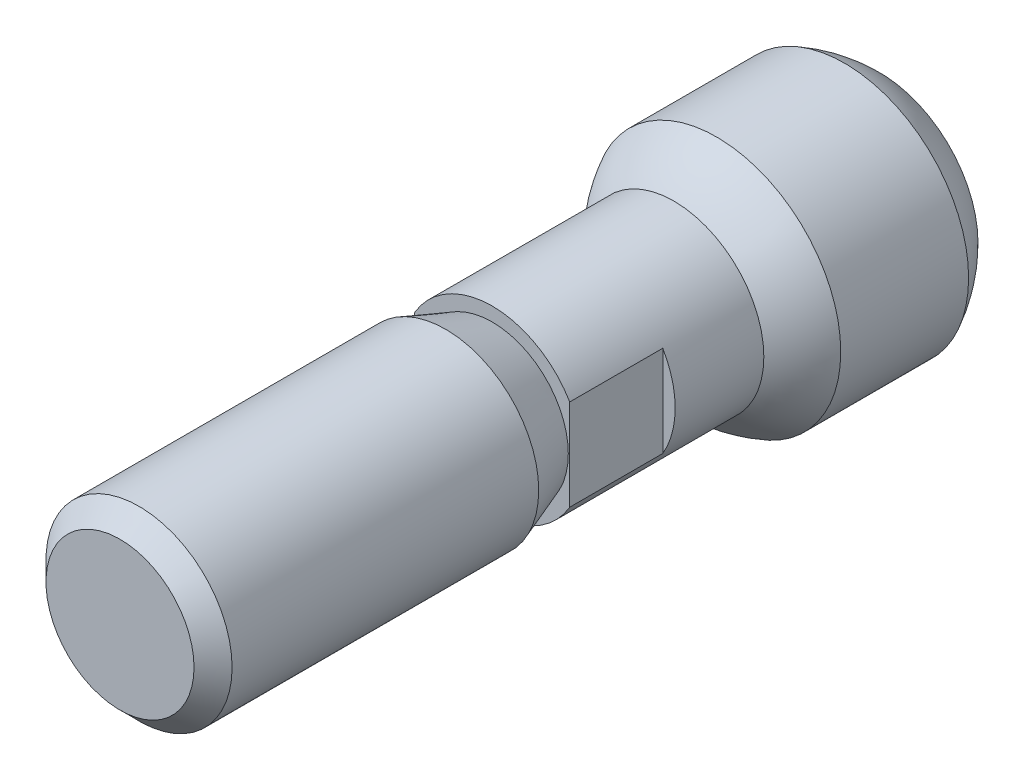
ISO-10303-21;
HEADER;
FILE_DESCRIPTION(('STEP AP214'),'2;1');
FILE_NAME('part.step','',(''),(''),'','','');
FILE_SCHEMA(('AUTOMOTIVE_DESIGN { 1 0 10303 214 1 1 1 1 }'));
ENDSEC;
DATA;
#1=APPLICATION_CONTEXT('core data for automotive mechanical design processes');
#2=APPLICATION_PROTOCOL_DEFINITION('international standard','automotive_design',2000,#1);
#3=PRODUCT_CONTEXT('',#1,'mechanical');
#4=PRODUCT('Part','Part','',(#3));
#5=PRODUCT_RELATED_PRODUCT_CATEGORY('part','',(#4));
#6=PRODUCT_DEFINITION_FORMATION('','',#4);
#7=PRODUCT_DEFINITION_CONTEXT('part definition',#1,'design');
#8=PRODUCT_DEFINITION('design','',#6,#7);
#9=PRODUCT_DEFINITION_SHAPE('','',#8);
#10=(LENGTH_UNIT() NAMED_UNIT(*) SI_UNIT(.MILLI.,.METRE.));
#11=(NAMED_UNIT(*) PLANE_ANGLE_UNIT() SI_UNIT($,.RADIAN.));
#12=(NAMED_UNIT(*) SI_UNIT($,.STERADIAN.) SOLID_ANGLE_UNIT());
#13=UNCERTAINTY_MEASURE_WITH_UNIT(LENGTH_MEASURE(1.E-05),#10,'distance_accuracy_value','');
#14=(GEOMETRIC_REPRESENTATION_CONTEXT(3) GLOBAL_UNCERTAINTY_ASSIGNED_CONTEXT((#13)) GLOBAL_UNIT_ASSIGNED_CONTEXT((#10,
#11,#12)) REPRESENTATION_CONTEXT('',''));
#15=CARTESIAN_POINT('',(0.,0.,0.));
#16=DIRECTION('',(0.,0.,1.));
#17=DIRECTION('',(1.,0.,0.));
#18=AXIS2_PLACEMENT_3D('',#15,#16,#17);
#19=CARTESIAN_POINT('',(0.,0.,1.01536202504548E-13));
#20=DIRECTION('',(0.,0.,-1.));
#21=DIRECTION('',(-1.,0.,0.));
#22=AXIS2_PLACEMENT_3D('',#19,#20,#21);
#23=PLANE('',#22);
#24=CARTESIAN_POINT('',(0.,0.,1.02348685082632E-13));
#25=DIRECTION('',(0.,0.,1.));
#26=DIRECTION('',(1.,0.,0.));
#27=AXIS2_PLACEMENT_3D('',#24,#25,#26);
#28=CIRCLE('',#27,2.9);
#29=CARTESIAN_POINT('',(2.5,1.46969384566974,1.02348685082632E-13));
#30=VERTEX_POINT('',#29);
#31=CARTESIAN_POINT('',(-2.5,1.46969384567006,1.02695629777827E-13));
#32=VERTEX_POINT('',#31);
#33=EDGE_CURVE('E100',#30,#32,#28,.T.);
#34=ORIENTED_EDGE('',*,*,#33,.T.);
#35=DIRECTION('',(0.,-1.,0.));
#36=VECTOR('',#35,1.);
#37=CARTESIAN_POINT('',(-2.5,0.,1.01883147199743E-13));
#38=LINE('',#37,#36);
#39=CARTESIAN_POINT('',(-2.5,-1.46969384567007,1.02348685082632E-13));
#40=VERTEX_POINT('',#39);
#41=EDGE_CURVE('E115',#32,#40,#38,.T.);
#42=ORIENTED_EDGE('',*,*,#41,.T.);
#43=CARTESIAN_POINT('',(2.5,-1.46969384566975,1.02001740387436E-13));
#44=VERTEX_POINT('',#43);
#45=EDGE_CURVE('E93',#40,#44,#28,.T.);
#46=ORIENTED_EDGE('',*,*,#45,.T.);
#47=DIRECTION('',(0.,1.,0.));
#48=VECTOR('',#47,1.);
#49=CARTESIAN_POINT('',(2.5,0.,1.01189257809352E-13));
#50=LINE('',#49,#48);
#51=EDGE_CURVE('E86',#44,#30,#50,.T.);
#52=ORIENTED_EDGE('',*,*,#51,.T.);
#53=EDGE_LOOP('',(#34,#42,#46,#52));
#54=FACE_BOUND('',#53,.T.);
#55=CARTESIAN_POINT('',(0.,0.,1.01536202504548E-13));
#56=DIRECTION('',(0.,0.,-1.));
#57=DIRECTION('',(-1.,0.,0.));
#58=AXIS2_PLACEMENT_3D('',#55,#56,#57);
#59=CIRCLE('',#58,2.45404464860074);
#60=CARTESIAN_POINT('',(-2.45404464860074,0.,1.0187676961359E-13));
#61=VERTEX_POINT('',#60);
#62=EDGE_CURVE('E11',#61,#61,#59,.F.);
#63=ORIENTED_EDGE('',*,*,#62,.F.);
#64=EDGE_LOOP('',(#63));
#65=FACE_BOUND('',#64,.T.);
#66=ADVANCED_FACE('F36',(#54,#65),#23,.F.);
#67=CARTESIAN_POINT('',(0.,0.,-12.4999999999989));
#68=DIRECTION('',(0.,0.,1.));
#69=DIRECTION('',(1.,0.,0.));
#70=AXIS2_PLACEMENT_3D('',#67,#68,#69);
#71=CYLINDRICAL_SURFACE('',#70,2.9);
#72=CARTESIAN_POINT('',(0.,0.,-3.));
#73=DIRECTION('',(0.,0.,1.));
#74=DIRECTION('',(1.,0.,0.));
#75=AXIS2_PLACEMENT_3D('',#72,#73,#74);
#76=CIRCLE('',#75,2.9);
#77=CARTESIAN_POINT('',(-2.5,1.46969384567006,-3.));
#78=VERTEX_POINT('',#77);
#79=CARTESIAN_POINT('',(-2.5,-1.46969384567006,-3.));
#80=VERTEX_POINT('',#79);
#81=EDGE_CURVE('E74',#78,#80,#76,.T.);
#82=ORIENTED_EDGE('',*,*,#81,.F.);
#83=DIRECTION('',(0.,0.,1.));
#84=VECTOR('',#83,1.);
#85=CARTESIAN_POINT('',(-2.5,1.46969384567007,-12.4999999999989));
#86=LINE('',#85,#84);
#87=EDGE_CURVE('E43',#78,#32,#86,.T.);
#88=ORIENTED_EDGE('',*,*,#87,.T.);
#89=ORIENTED_EDGE('',*,*,#33,.F.);
#90=DIRECTION('',(0.,0.,1.));
#91=VECTOR('',#90,1.);
#92=CARTESIAN_POINT('',(2.5,1.46969384566974,-12.4999999999989));
#93=LINE('',#92,#91);
#94=CARTESIAN_POINT('',(2.5,1.46969384566975,-3.));
#95=VERTEX_POINT('',#94);
#96=EDGE_CURVE('E97',#30,#95,#93,.F.);
#97=ORIENTED_EDGE('',*,*,#96,.T.);
#98=CARTESIAN_POINT('',(2.5,-1.46969384566975,-3.));
#99=VERTEX_POINT('',#98);
#100=EDGE_CURVE('E82',#99,#95,#76,.T.);
#101=ORIENTED_EDGE('',*,*,#100,.F.);
#102=DIRECTION('',(0.,0.,1.));
#103=VECTOR('',#102,1.);
#104=CARTESIAN_POINT('',(2.5,-1.46969384566974,-12.4999999999989));
#105=LINE('',#104,#103);
#106=EDGE_CURVE('E80',#99,#44,#105,.T.);
#107=ORIENTED_EDGE('',*,*,#106,.T.);
#108=ORIENTED_EDGE('',*,*,#45,.F.);
#109=DIRECTION('',(0.,0.,1.));
#110=VECTOR('',#109,1.);
#111=CARTESIAN_POINT('',(-2.5,-1.46969384567007,-12.4999999999989));
#112=LINE('',#111,#110);
#113=EDGE_CURVE('E79',#40,#80,#112,.F.);
#114=ORIENTED_EDGE('',*,*,#113,.T.);
#115=EDGE_LOOP('',(#82,#88,#89,#97,#101,#107,#108,#114));
#116=FACE_BOUND('',#115,.T.);
#117=CARTESIAN_POINT('',(0.,0.,-5.8590698931828));
#118=DIRECTION('',(0.,0.,1.));
#119=DIRECTION('',(1.,0.,0.));
#120=AXIS2_PLACEMENT_3D('',#117,#118,#119);
#121=CIRCLE('',#120,2.9);
#122=CARTESIAN_POINT('',(2.89999999999991,0.,-5.8590698931828));
#123=VERTEX_POINT('',#122);
#124=EDGE_CURVE('E103',#123,#123,#121,.T.);
#125=ORIENTED_EDGE('',*,*,#124,.T.);
#126=EDGE_LOOP('',(#125));
#127=FACE_BOUND('',#126,.T.);
#128=ADVANCED_FACE('F89',(#116,#127),#71,.T.);
#129=CARTESIAN_POINT('',(9.03790930983916E-13,0.,-9.3000000000001));
#130=DIRECTION('',(0.,0.,1.));
#131=DIRECTION('',(-1.,0.,0.));
#132=AXIS2_PLACEMENT_3D('',#129,#130,#131);
#133=SPHERICAL_SURFACE('',#132,4.50000000000083);
#134=ORIENTED_EDGE('',*,*,#124,.F.);
#135=EDGE_LOOP('',(#134));
#136=FACE_BOUND('',#135,.T.);
#137=CARTESIAN_POINT('',(0.,0.,-7.2384471871912));
#138=DIRECTION('',(0.,0.,1.));
#139=DIRECTION('',(1.,0.,0.));
#140=AXIS2_PLACEMENT_3D('',#137,#138,#139);
#141=CIRCLE('',#140,3.99999999999991);
#142=CARTESIAN_POINT('',(3.99999999999981,0.,-7.2384471871912));
#143=VERTEX_POINT('',#142);
#144=EDGE_CURVE('E106',#143,#143,#141,.T.);
#145=ORIENTED_EDGE('',*,*,#144,.T.);
#146=EDGE_LOOP('',(#145));
#147=FACE_BOUND('',#146,.T.);
#148=ADVANCED_FACE('F143',(#136,#147),#133,.T.);
#149=CARTESIAN_POINT('',(0.,0.,-12.4999999999989));
#150=DIRECTION('',(0.,0.,1.));
#151=DIRECTION('',(1.,0.,0.));
#152=AXIS2_PLACEMENT_3D('',#149,#150,#151);
#153=CYLINDRICAL_SURFACE('',#152,3.99999999999991);
#154=ORIENTED_EDGE('',*,*,#144,.F.);
#155=EDGE_LOOP('',(#154));
#156=FACE_BOUND('',#155,.T.);
#157=CARTESIAN_POINT('',(0.,0.,-11.361552812809));
#158=DIRECTION('',(0.,0.,1.));
#159=DIRECTION('',(1.,0.,0.));
#160=AXIS2_PLACEMENT_3D('',#157,#158,#159);
#161=CIRCLE('',#160,3.99999999999991);
#162=CARTESIAN_POINT('',(3.99999999999981,0.,-11.361552812809));
#163=VERTEX_POINT('',#162);
#164=EDGE_CURVE('E109',#163,#163,#161,.T.);
#165=ORIENTED_EDGE('',*,*,#164,.T.);
#166=EDGE_LOOP('',(#165));
#167=FACE_BOUND('',#166,.T.);
#168=ADVANCED_FACE('F165',(#156,#167),#153,.T.);
#169=CARTESIAN_POINT('',(9.03790930983916E-13,0.,-9.3000000000001));
#170=DIRECTION('',(0.,0.,1.));
#171=DIRECTION('',(-1.,0.,0.));
#172=AXIS2_PLACEMENT_3D('',#169,#170,#171);
#173=SPHERICAL_SURFACE('',#172,4.50000000000083);
#174=ORIENTED_EDGE('',*,*,#164,.F.);
#175=EDGE_LOOP('',(#174));
#176=FACE_BOUND('',#175,.T.);
#177=CARTESIAN_POINT('',(0.,0.,-12.4999999999989));
#178=DIRECTION('',(0.,0.,1.));
#179=DIRECTION('',(1.,0.,0.));
#180=AXIS2_PLACEMENT_3D('',#177,#178,#179);
#181=CIRCLE('',#180,3.16385840391269);
#182=CARTESIAN_POINT('',(3.1638584039126,0.,-12.4999999999989));
#183=VERTEX_POINT('',#182);
#184=EDGE_CURVE('E112',#183,#183,#181,.T.);
#185=ORIENTED_EDGE('',*,*,#184,.T.);
#186=EDGE_LOOP('',(#185));
#187=FACE_BOUND('',#186,.T.);
#188=ADVANCED_FACE('F161',(#176,#187),#173,.T.);
#189=CARTESIAN_POINT('',(-3.16385840391279,0.,-12.4999999999989));
#190=DIRECTION('',(0.,0.,1.));
#191=DIRECTION('',(1.,0.,0.));
#192=AXIS2_PLACEMENT_3D('',#189,#190,#191);
#193=PLANE('',#192);
#194=ORIENTED_EDGE('',*,*,#184,.F.);
#195=EDGE_LOOP('',(#194));
#196=FACE_BOUND('',#195,.T.);
#197=ADVANCED_FACE('F156',(#196),#193,.F.);
#198=CARTESIAN_POINT('',(0.,0.,-3.));
#199=DIRECTION('',(0.,0.,1.));
#200=DIRECTION('',(1.,0.,0.));
#201=AXIS2_PLACEMENT_3D('',#198,#199,#200);
#202=PLANE('',#201);
#203=ORIENTED_EDGE('',*,*,#100,.T.);
#204=DIRECTION('',(0.,-1.,0.));
#205=VECTOR('',#204,1.);
#206=CARTESIAN_POINT('',(2.5,4.,-3.));
#207=LINE('',#206,#205);
#208=EDGE_CURVE('E56',#95,#99,#207,.T.);
#209=ORIENTED_EDGE('',*,*,#208,.T.);
#210=EDGE_LOOP('',(#203,#209));
#211=FACE_BOUND('',#210,.T.);
#212=ADVANCED_FACE('F149',(#211),#202,.T.);
#213=CARTESIAN_POINT('',(2.5,4.,-3.));
#214=DIRECTION('',(-1.,0.,0.));
#215=DIRECTION('',(0.,0.,1.));
#216=AXIS2_PLACEMENT_3D('',#213,#214,#215);
#217=PLANE('',#216);
#218=ORIENTED_EDGE('',*,*,#208,.F.);
#219=ORIENTED_EDGE('',*,*,#96,.F.);
#220=ORIENTED_EDGE('',*,*,#51,.F.);
#221=ORIENTED_EDGE('',*,*,#106,.F.);
#222=EDGE_LOOP('',(#218,#219,#220,#221));
#223=FACE_BOUND('',#222,.T.);
#224=ADVANCED_FACE('F147',(#223),#217,.F.);
#225=CARTESIAN_POINT('',(-2.5,-5.,-3.));
#226=DIRECTION('',(1.,0.,0.));
#227=DIRECTION('',(0.,0.,-1.));
#228=AXIS2_PLACEMENT_3D('',#225,#226,#227);
#229=PLANE('',#228);
#230=DIRECTION('',(0.,1.,0.));
#231=VECTOR('',#230,1.);
#232=CARTESIAN_POINT('',(-2.5,-5.,-3.));
#233=LINE('',#232,#231);
#234=EDGE_CURVE('E49',#80,#78,#233,.T.);
#235=ORIENTED_EDGE('',*,*,#234,.F.);
#236=ORIENTED_EDGE('',*,*,#113,.F.);
#237=ORIENTED_EDGE('',*,*,#41,.F.);
#238=ORIENTED_EDGE('',*,*,#87,.F.);
#239=EDGE_LOOP('',(#235,#236,#237,#238));
#240=FACE_BOUND('',#239,.T.);
#241=ADVANCED_FACE('F84',(#240),#229,.F.);
#242=ORIENTED_EDGE('',*,*,#81,.T.);
#243=ORIENTED_EDGE('',*,*,#234,.T.);
#244=EDGE_LOOP('',(#242,#243));
#245=FACE_BOUND('',#244,.T.);
#246=ADVANCED_FACE('F75',(#245),#202,.T.);
#247=CARTESIAN_POINT('',(0.,0.,12.));
#248=DIRECTION('',(0.,0.,-1.));
#249=DIRECTION('',(-1.,0.,0.));
#250=AXIS2_PLACEMENT_3D('',#247,#248,#249);
#251=PLANE('',#250);
#252=CARTESIAN_POINT('',(0.,0.,12.));
#253=DIRECTION('',(0.,0.,1.));
#254=DIRECTION('',(1.,0.,0.));
#255=AXIS2_PLACEMENT_3D('',#252,#253,#254);
#256=CIRCLE('',#255,2.3865);
#257=CARTESIAN_POINT('',(2.3865,0.,12.));
#258=VERTEX_POINT('',#257);
#259=EDGE_CURVE('E120',#258,#258,#256,.T.);
#260=ORIENTED_EDGE('',*,*,#259,.T.);
#261=EDGE_LOOP('',(#260));
#262=FACE_BOUND('',#261,.T.);
#263=ADVANCED_FACE('F223',(#262),#251,.F.);
#264=CARTESIAN_POINT('',(0.,0.,11.3865));
#265=DIRECTION('',(0.,0.,-1.));
#266=DIRECTION('',(-1.,0.,0.));
#267=AXIS2_PLACEMENT_3D('',#264,#265,#266);
#268=CONICAL_SURFACE('',#267,3.,0.785398163397449);
#269=ORIENTED_EDGE('',*,*,#259,.F.);
#270=EDGE_LOOP('',(#269));
#271=FACE_BOUND('',#270,.T.);
#272=CARTESIAN_POINT('',(0.,0.,11.3865));
#273=DIRECTION('',(0.,0.,1.));
#274=DIRECTION('',(1.,0.,0.));
#275=AXIS2_PLACEMENT_3D('',#272,#273,#274);
#276=CIRCLE('',#275,3.);
#277=CARTESIAN_POINT('',(3.,0.,11.3865));
#278=VERTEX_POINT('',#277);
#279=EDGE_CURVE('E123',#278,#278,#276,.T.);
#280=ORIENTED_EDGE('',*,*,#279,.T.);
#281=EDGE_LOOP('',(#280));
#282=FACE_BOUND('',#281,.T.);
#283=ADVANCED_FACE('F227',(#271,#282),#268,.T.);
#284=CARTESIAN_POINT('',(0.,0.,0.));
#285=DIRECTION('',(0.,0.,1.));
#286=DIRECTION('',(1.,0.,0.));
#287=AXIS2_PLACEMENT_3D('',#284,#285,#286);
#288=CYLINDRICAL_SURFACE('',#287,3.);
#289=ORIENTED_EDGE('',*,*,#279,.F.);
#290=EDGE_LOOP('',(#289));
#291=FACE_BOUND('',#290,.T.);
#292=CARTESIAN_POINT('',(0.,0.,1.5));
#293=DIRECTION('',(0.,0.,1.));
#294=DIRECTION('',(1.,0.,0.));
#295=AXIS2_PLACEMENT_3D('',#292,#293,#294);
#296=CIRCLE('',#295,3.);
#297=CARTESIAN_POINT('',(3.,0.,1.5));
#298=VERTEX_POINT('',#297);
#299=EDGE_CURVE('E126',#298,#298,#296,.T.);
#300=ORIENTED_EDGE('',*,*,#299,.T.);
#301=EDGE_LOOP('',(#300));
#302=FACE_BOUND('',#301,.T.);
#303=ADVANCED_FACE('F130',(#291,#302),#288,.T.);
#304=CARTESIAN_POINT('',(0.,0.,0.));
#305=DIRECTION('',(0.,0.,1.));
#306=DIRECTION('',(1.,0.,0.));
#307=AXIS2_PLACEMENT_3D('',#304,#305,#306);
#308=CONICAL_SURFACE('',#307,2.4540446486007,0.349065850398864);
#309=ORIENTED_EDGE('',*,*,#299,.F.);
#310=EDGE_LOOP('',(#309));
#311=FACE_BOUND('',#310,.T.);
#312=ORIENTED_EDGE('',*,*,#62,.T.);
#313=EDGE_LOOP('',(#312));
#314=FACE_BOUND('',#313,.T.);
#315=ADVANCED_FACE('F132',(#311,#314),#308,.T.);
#316=CLOSED_SHELL('',(#66,#128,#148,#168,#188,#197,#212,#224,#241,#246,#263,#283,#303,#315));
#317=MANIFOLD_SOLID_BREP('B2',#316);
#318=ADVANCED_BREP_SHAPE_REPRESENTATION('',(#18,#317),#14);
#319=SHAPE_DEFINITION_REPRESENTATION(#9,#318);
ENDSEC;
END-ISO-10303-21;
